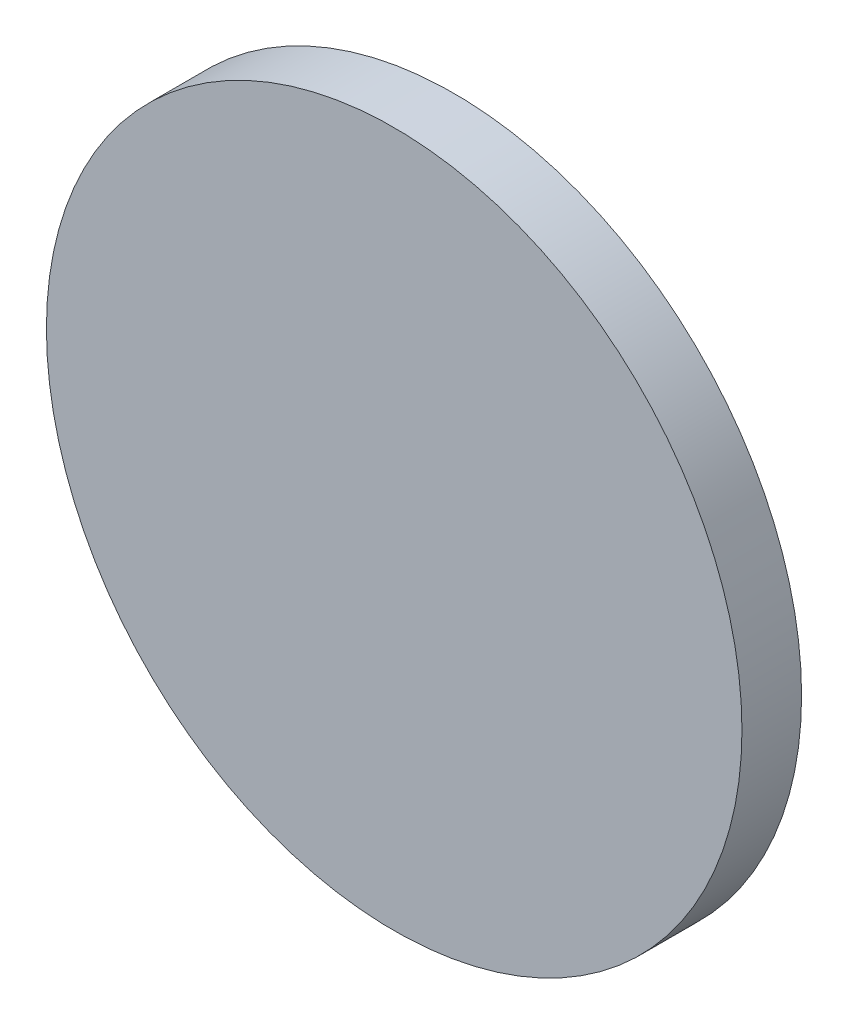
ISO-10303-21;
HEADER;
FILE_DESCRIPTION(('STEP AP214'),'2;1');
FILE_NAME('part.step','',(''),(''),'','','');
FILE_SCHEMA(('AUTOMOTIVE_DESIGN { 1 0 10303 214 1 1 1 1 }'));
ENDSEC;
DATA;
#1=APPLICATION_CONTEXT('core data for automotive mechanical design processes');
#2=APPLICATION_PROTOCOL_DEFINITION('international standard','automotive_design',2000,#1);
#3=PRODUCT_CONTEXT('',#1,'mechanical');
#4=PRODUCT('Part','Part','',(#3));
#5=PRODUCT_RELATED_PRODUCT_CATEGORY('part','',(#4));
#6=PRODUCT_DEFINITION_FORMATION('','',#4);
#7=PRODUCT_DEFINITION_CONTEXT('part definition',#1,'design');
#8=PRODUCT_DEFINITION('design','',#6,#7);
#9=PRODUCT_DEFINITION_SHAPE('','',#8);
#10=(LENGTH_UNIT() NAMED_UNIT(*) SI_UNIT(.MILLI.,.METRE.));
#11=(NAMED_UNIT(*) PLANE_ANGLE_UNIT() SI_UNIT($,.RADIAN.));
#12=(NAMED_UNIT(*) SI_UNIT($,.STERADIAN.) SOLID_ANGLE_UNIT());
#13=UNCERTAINTY_MEASURE_WITH_UNIT(LENGTH_MEASURE(1.E-05),#10,'distance_accuracy_value','');
#14=(GEOMETRIC_REPRESENTATION_CONTEXT(3) GLOBAL_UNCERTAINTY_ASSIGNED_CONTEXT((#13)) GLOBAL_UNIT_ASSIGNED_CONTEXT((#10,
#11,#12)) REPRESENTATION_CONTEXT('',''));
#15=CARTESIAN_POINT('',(0.,0.,0.));
#16=DIRECTION('',(0.,0.,1.));
#17=DIRECTION('',(1.,0.,0.));
#18=AXIS2_PLACEMENT_3D('',#15,#16,#17);
#19=CARTESIAN_POINT('',(3.07848,7.211060006176,0.79916));
#20=DIRECTION('',(0.,0.,1.));
#21=DIRECTION('',(1.,0.,0.));
#22=AXIS2_PLACEMENT_3D('',#19,#20,#21);
#23=PLANE('',#22);
#24=CARTESIAN_POINT('',(3.07848,7.211060006176,0.79916));
#25=DIRECTION('',(0.,0.,1.));
#26=DIRECTION('',(1.,0.,0.));
#27=AXIS2_PLACEMENT_3D('',#24,#25,#26);
#28=CIRCLE('',#27,0.200024667);
#29=CARTESIAN_POINT('',(3.278504667,7.211060006176,0.79916));
#30=VERTEX_POINT('',#29);
#31=EDGE_CURVE('E18',#30,#30,#28,.F.);
#32=ORIENTED_EDGE('',*,*,#31,.F.);
#33=EDGE_LOOP('',(#32));
#34=FACE_BOUND('',#33,.T.);
#35=ADVANCED_FACE('F15',(#34),#23,.T.);
#36=CARTESIAN_POINT('',(3.07848,7.211060006176,0.76487));
#37=DIRECTION('',(0.,0.,1.));
#38=DIRECTION('',(1.,0.,0.));
#39=AXIS2_PLACEMENT_3D('',#36,#37,#38);
#40=CYLINDRICAL_SURFACE('',#39,0.200024667);
#41=ORIENTED_EDGE('',*,*,#31,.T.);
#42=EDGE_LOOP('',(#41));
#43=FACE_BOUND('',#42,.T.);
#44=CARTESIAN_POINT('',(3.07848,7.211060006176,0.76487));
#45=DIRECTION('',(0.,0.,1.));
#46=DIRECTION('',(1.,0.,0.));
#47=AXIS2_PLACEMENT_3D('',#44,#45,#46);
#48=CIRCLE('',#47,0.200024667);
#49=CARTESIAN_POINT('',(3.278504667,7.211060006176,0.76487));
#50=VERTEX_POINT('',#49);
#51=EDGE_CURVE('E10',#50,#50,#48,.F.);
#52=ORIENTED_EDGE('',*,*,#51,.F.);
#53=EDGE_LOOP('',(#52));
#54=FACE_BOUND('',#53,.T.);
#55=ADVANCED_FACE('F27',(#43,#54),#40,.T.);
#56=CARTESIAN_POINT('',(3.07848,7.211060006176,0.76487));
#57=DIRECTION('',(0.,0.,-1.));
#58=DIRECTION('',(-1.,0.,0.));
#59=AXIS2_PLACEMENT_3D('',#56,#57,#58);
#60=PLANE('',#59);
#61=ORIENTED_EDGE('',*,*,#51,.T.);
#62=EDGE_LOOP('',(#61));
#63=FACE_BOUND('',#62,.T.);
#64=ADVANCED_FACE('F35',(#63),#60,.T.);
#65=CLOSED_SHELL('',(#35,#55,#64));
#66=MANIFOLD_SOLID_BREP('B1',#65);
#67=ADVANCED_BREP_SHAPE_REPRESENTATION('',(#18,#66),#14);
#68=SHAPE_DEFINITION_REPRESENTATION(#9,#67);
ENDSEC;
END-ISO-10303-21;
